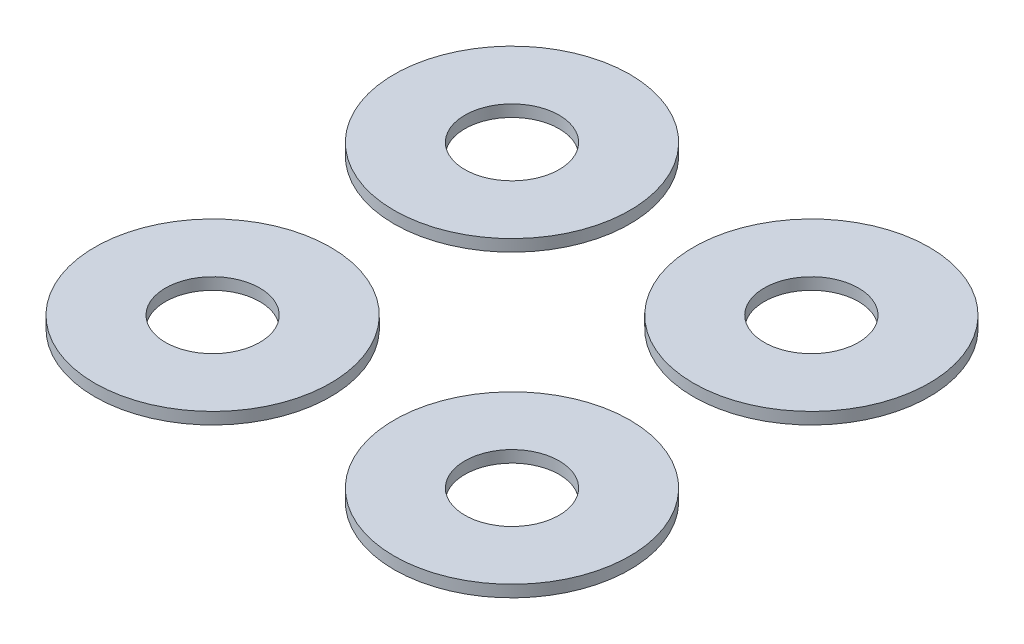
ISO-10303-21;
HEADER;
FILE_DESCRIPTION(('STEP AP214'),'2;1');
FILE_NAME('part.step','',(''),(''),'','','');
FILE_SCHEMA(('AUTOMOTIVE_DESIGN { 1 0 10303 214 1 1 1 1 }'));
ENDSEC;
DATA;
#1=APPLICATION_CONTEXT('core data for automotive mechanical design processes');
#2=APPLICATION_PROTOCOL_DEFINITION('international standard','automotive_design',2000,#1);
#3=PRODUCT_CONTEXT('',#1,'mechanical');
#4=PRODUCT('Part','Part','',(#3));
#5=PRODUCT_RELATED_PRODUCT_CATEGORY('part','',(#4));
#6=PRODUCT_DEFINITION_FORMATION('','',#4);
#7=PRODUCT_DEFINITION_CONTEXT('part definition',#1,'design');
#8=PRODUCT_DEFINITION('design','',#6,#7);
#9=PRODUCT_DEFINITION_SHAPE('','',#8);
#10=(LENGTH_UNIT() NAMED_UNIT(*) SI_UNIT(.MILLI.,.METRE.));
#11=(NAMED_UNIT(*) PLANE_ANGLE_UNIT() SI_UNIT($,.RADIAN.));
#12=(NAMED_UNIT(*) SI_UNIT($,.STERADIAN.) SOLID_ANGLE_UNIT());
#13=UNCERTAINTY_MEASURE_WITH_UNIT(LENGTH_MEASURE(1.E-05),#10,'distance_accuracy_value','');
#14=(GEOMETRIC_REPRESENTATION_CONTEXT(3) GLOBAL_UNCERTAINTY_ASSIGNED_CONTEXT((#13)) GLOBAL_UNIT_ASSIGNED_CONTEXT((#10,
#11,#12)) REPRESENTATION_CONTEXT('',''));
#15=CARTESIAN_POINT('',(0.,0.,0.));
#16=DIRECTION('',(0.,0.,1.));
#17=DIRECTION('',(1.,0.,0.));
#18=AXIS2_PLACEMENT_3D('',#15,#16,#17);
#19=CARTESIAN_POINT('',(0.,0.1,0.));
#20=DIRECTION('',(0.,-1.,0.));
#21=DIRECTION('',(0.,0.,-1.));
#22=AXIS2_PLACEMENT_3D('',#19,#20,#21);
#23=CYLINDRICAL_SURFACE('',#22,1.);
#24=CARTESIAN_POINT('',(0.,0.1,0.));
#25=DIRECTION('',(0.,-1.,0.));
#26=DIRECTION('',(0.,0.,-1.));
#27=AXIS2_PLACEMENT_3D('',#24,#25,#26);
#28=CIRCLE('',#27,1.);
#29=CARTESIAN_POINT('',(0.,0.1,-1.));
#30=VERTEX_POINT('',#29);
#31=EDGE_CURVE('P0_E18',#30,#30,#28,.F.);
#32=ORIENTED_EDGE('',*,*,#31,.F.);
#33=EDGE_LOOP('',(#32));
#34=FACE_BOUND('',#33,.T.);
#35=CARTESIAN_POINT('',(0.,0.,0.));
#36=DIRECTION('',(0.,-1.,0.));
#37=DIRECTION('',(0.,0.,-1.));
#38=AXIS2_PLACEMENT_3D('',#35,#36,#37);
#39=CIRCLE('',#38,1.);
#40=CARTESIAN_POINT('',(0.,0.,-1.));
#41=VERTEX_POINT('',#40);
#42=EDGE_CURVE('P0_E27',#41,#41,#39,.F.);
#43=ORIENTED_EDGE('',*,*,#42,.T.);
#44=EDGE_LOOP('',(#43));
#45=FACE_BOUND('',#44,.T.);
#46=ADVANCED_FACE('P0_F14',(#34,#45),#23,.T.);
#47=CARTESIAN_POINT('',(-1.012,0.1,-1.012));
#48=DIRECTION('',(0.,1.,0.));
#49=DIRECTION('',(0.,0.,1.));
#50=AXIS2_PLACEMENT_3D('',#47,#48,#49);
#51=PLANE('',#50);
#52=CARTESIAN_POINT('',(0.,0.1,0.));
#53=DIRECTION('',(0.,-1.,0.));
#54=DIRECTION('',(0.,0.,-1.));
#55=AXIS2_PLACEMENT_3D('',#52,#53,#54);
#56=CIRCLE('',#55,0.4);
#57=CARTESIAN_POINT('',(0.,0.1,-0.4));
#58=VERTEX_POINT('',#57);
#59=EDGE_CURVE('P0_E22',#58,#58,#56,.F.);
#60=ORIENTED_EDGE('',*,*,#59,.F.);
#61=EDGE_LOOP('',(#60));
#62=FACE_BOUND('',#61,.T.);
#63=ORIENTED_EDGE('',*,*,#31,.T.);
#64=EDGE_LOOP('',(#63));
#65=FACE_BOUND('',#64,.T.);
#66=ADVANCED_FACE('P0_F35',(#62,#65),#51,.T.);
#67=CARTESIAN_POINT('',(-1.012,0.,-1.012));
#68=DIRECTION('',(0.,1.,0.));
#69=DIRECTION('',(0.,0.,1.));
#70=AXIS2_PLACEMENT_3D('',#67,#68,#69);
#71=PLANE('',#70);
#72=CARTESIAN_POINT('',(0.,0.,0.));
#73=DIRECTION('',(0.,-1.,0.));
#74=DIRECTION('',(0.,0.,-1.));
#75=AXIS2_PLACEMENT_3D('',#72,#73,#74);
#76=CIRCLE('',#75,0.4);
#77=CARTESIAN_POINT('',(0.,0.,-0.4));
#78=VERTEX_POINT('',#77);
#79=EDGE_CURVE('P0_E10',#78,#78,#76,.T.);
#80=ORIENTED_EDGE('',*,*,#79,.F.);
#81=EDGE_LOOP('',(#80));
#82=FACE_BOUND('',#81,.T.);
#83=ORIENTED_EDGE('',*,*,#42,.F.);
#84=EDGE_LOOP('',(#83));
#85=FACE_BOUND('',#84,.T.);
#86=ADVANCED_FACE('P0_F16',(#82,#85),#71,.F.);
#87=CARTESIAN_POINT('',(0.,0.1,0.));
#88=DIRECTION('',(0.,-1.,0.));
#89=DIRECTION('',(0.,0.,-1.));
#90=AXIS2_PLACEMENT_3D('',#87,#88,#89);
#91=CYLINDRICAL_SURFACE('',#90,0.4);
#92=ORIENTED_EDGE('',*,*,#79,.T.);
#93=EDGE_LOOP('',(#92));
#94=FACE_BOUND('',#93,.T.);
#95=ORIENTED_EDGE('',*,*,#59,.T.);
#96=EDGE_LOOP('',(#95));
#97=FACE_BOUND('',#96,.T.);
#98=ADVANCED_FACE('P0_F45',(#94,#97),#91,.F.);
#99=CLOSED_SHELL('',(#46,#66,#86,#98));
#100=MANIFOLD_SOLID_BREP('P0_B1',#99);
#101=CARTESIAN_POINT('',(0.,0.1,-2.54));
#102=DIRECTION('',(0.,-1.,0.));
#103=DIRECTION('',(0.,0.,-1.));
#104=AXIS2_PLACEMENT_3D('',#101,#102,#103);
#105=CYLINDRICAL_SURFACE('',#104,1.);
#106=CARTESIAN_POINT('',(0.,0.1,-2.54));
#107=DIRECTION('',(0.,-1.,0.));
#108=DIRECTION('',(0.,0.,-1.));
#109=AXIS2_PLACEMENT_3D('',#106,#107,#108);
#110=CIRCLE('',#109,1.);
#111=CARTESIAN_POINT('',(0.,0.1,-3.54));
#112=VERTEX_POINT('',#111);
#113=EDGE_CURVE('P1_E18',#112,#112,#110,.F.);
#114=ORIENTED_EDGE('',*,*,#113,.F.);
#115=EDGE_LOOP('',(#114));
#116=FACE_BOUND('',#115,.T.);
#117=CARTESIAN_POINT('',(0.,0.,-2.54));
#118=DIRECTION('',(0.,-1.,0.));
#119=DIRECTION('',(0.,0.,-1.));
#120=AXIS2_PLACEMENT_3D('',#117,#118,#119);
#121=CIRCLE('',#120,1.);
#122=CARTESIAN_POINT('',(0.,0.,-3.54));
#123=VERTEX_POINT('',#122);
#124=EDGE_CURVE('P1_E27',#123,#123,#121,.F.);
#125=ORIENTED_EDGE('',*,*,#124,.T.);
#126=EDGE_LOOP('',(#125));
#127=FACE_BOUND('',#126,.T.);
#128=ADVANCED_FACE('P1_F14',(#116,#127),#105,.T.);
#129=CARTESIAN_POINT('',(-1.012,0.1,-3.552));
#130=DIRECTION('',(0.,1.,0.));
#131=DIRECTION('',(0.,0.,1.));
#132=AXIS2_PLACEMENT_3D('',#129,#130,#131);
#133=PLANE('',#132);
#134=CARTESIAN_POINT('',(0.,0.1,-2.54));
#135=DIRECTION('',(0.,-1.,0.));
#136=DIRECTION('',(0.,0.,-1.));
#137=AXIS2_PLACEMENT_3D('',#134,#135,#136);
#138=CIRCLE('',#137,0.4);
#139=CARTESIAN_POINT('',(0.,0.1,-2.94));
#140=VERTEX_POINT('',#139);
#141=EDGE_CURVE('P1_E22',#140,#140,#138,.F.);
#142=ORIENTED_EDGE('',*,*,#141,.F.);
#143=EDGE_LOOP('',(#142));
#144=FACE_BOUND('',#143,.T.);
#145=ORIENTED_EDGE('',*,*,#113,.T.);
#146=EDGE_LOOP('',(#145));
#147=FACE_BOUND('',#146,.T.);
#148=ADVANCED_FACE('P1_F35',(#144,#147),#133,.T.);
#149=CARTESIAN_POINT('',(-1.012,0.,-3.552));
#150=DIRECTION('',(0.,1.,0.));
#151=DIRECTION('',(0.,0.,1.));
#152=AXIS2_PLACEMENT_3D('',#149,#150,#151);
#153=PLANE('',#152);
#154=CARTESIAN_POINT('',(0.,0.,-2.54));
#155=DIRECTION('',(0.,-1.,0.));
#156=DIRECTION('',(0.,0.,-1.));
#157=AXIS2_PLACEMENT_3D('',#154,#155,#156);
#158=CIRCLE('',#157,0.4);
#159=CARTESIAN_POINT('',(0.,0.,-2.94));
#160=VERTEX_POINT('',#159);
#161=EDGE_CURVE('P1_E10',#160,#160,#158,.T.);
#162=ORIENTED_EDGE('',*,*,#161,.F.);
#163=EDGE_LOOP('',(#162));
#164=FACE_BOUND('',#163,.T.);
#165=ORIENTED_EDGE('',*,*,#124,.F.);
#166=EDGE_LOOP('',(#165));
#167=FACE_BOUND('',#166,.T.);
#168=ADVANCED_FACE('P1_F16',(#164,#167),#153,.F.);
#169=CARTESIAN_POINT('',(0.,0.1,-2.54));
#170=DIRECTION('',(0.,-1.,0.));
#171=DIRECTION('',(0.,0.,-1.));
#172=AXIS2_PLACEMENT_3D('',#169,#170,#171);
#173=CYLINDRICAL_SURFACE('',#172,0.4);
#174=ORIENTED_EDGE('',*,*,#161,.T.);
#175=EDGE_LOOP('',(#174));
#176=FACE_BOUND('',#175,.T.);
#177=ORIENTED_EDGE('',*,*,#141,.T.);
#178=EDGE_LOOP('',(#177));
#179=FACE_BOUND('',#178,.T.);
#180=ADVANCED_FACE('P1_F45',(#176,#179),#173,.F.);
#181=CLOSED_SHELL('',(#128,#148,#168,#180));
#182=MANIFOLD_SOLID_BREP('P1_B1',#181);
#183=CARTESIAN_POINT('',(2.54,0.1,-2.54));
#184=DIRECTION('',(0.,-1.,0.));
#185=DIRECTION('',(0.,0.,-1.));
#186=AXIS2_PLACEMENT_3D('',#183,#184,#185);
#187=CYLINDRICAL_SURFACE('',#186,1.);
#188=CARTESIAN_POINT('',(2.54,0.1,-2.54));
#189=DIRECTION('',(0.,-1.,0.));
#190=DIRECTION('',(0.,0.,-1.));
#191=AXIS2_PLACEMENT_3D('',#188,#189,#190);
#192=CIRCLE('',#191,1.);
#193=CARTESIAN_POINT('',(2.54,0.1,-3.54));
#194=VERTEX_POINT('',#193);
#195=EDGE_CURVE('P2_E18',#194,#194,#192,.F.);
#196=ORIENTED_EDGE('',*,*,#195,.F.);
#197=EDGE_LOOP('',(#196));
#198=FACE_BOUND('',#197,.T.);
#199=CARTESIAN_POINT('',(2.54,0.,-2.54));
#200=DIRECTION('',(0.,-1.,0.));
#201=DIRECTION('',(0.,0.,-1.));
#202=AXIS2_PLACEMENT_3D('',#199,#200,#201);
#203=CIRCLE('',#202,1.);
#204=CARTESIAN_POINT('',(2.54,0.,-3.54));
#205=VERTEX_POINT('',#204);
#206=EDGE_CURVE('P2_E27',#205,#205,#203,.F.);
#207=ORIENTED_EDGE('',*,*,#206,.T.);
#208=EDGE_LOOP('',(#207));
#209=FACE_BOUND('',#208,.T.);
#210=ADVANCED_FACE('P2_F14',(#198,#209),#187,.T.);
#211=CARTESIAN_POINT('',(1.528,0.1,-3.552));
#212=DIRECTION('',(0.,1.,0.));
#213=DIRECTION('',(0.,0.,1.));
#214=AXIS2_PLACEMENT_3D('',#211,#212,#213);
#215=PLANE('',#214);
#216=CARTESIAN_POINT('',(2.54,0.1,-2.54));
#217=DIRECTION('',(0.,-1.,0.));
#218=DIRECTION('',(0.,0.,-1.));
#219=AXIS2_PLACEMENT_3D('',#216,#217,#218);
#220=CIRCLE('',#219,0.4);
#221=CARTESIAN_POINT('',(2.54,0.1,-2.94));
#222=VERTEX_POINT('',#221);
#223=EDGE_CURVE('P2_E22',#222,#222,#220,.F.);
#224=ORIENTED_EDGE('',*,*,#223,.F.);
#225=EDGE_LOOP('',(#224));
#226=FACE_BOUND('',#225,.T.);
#227=ORIENTED_EDGE('',*,*,#195,.T.);
#228=EDGE_LOOP('',(#227));
#229=FACE_BOUND('',#228,.T.);
#230=ADVANCED_FACE('P2_F35',(#226,#229),#215,.T.);
#231=CARTESIAN_POINT('',(1.528,0.,-3.552));
#232=DIRECTION('',(0.,1.,0.));
#233=DIRECTION('',(0.,0.,1.));
#234=AXIS2_PLACEMENT_3D('',#231,#232,#233);
#235=PLANE('',#234);
#236=CARTESIAN_POINT('',(2.54,0.,-2.54));
#237=DIRECTION('',(0.,-1.,0.));
#238=DIRECTION('',(0.,0.,-1.));
#239=AXIS2_PLACEMENT_3D('',#236,#237,#238);
#240=CIRCLE('',#239,0.4);
#241=CARTESIAN_POINT('',(2.54,0.,-2.94));
#242=VERTEX_POINT('',#241);
#243=EDGE_CURVE('P2_E10',#242,#242,#240,.T.);
#244=ORIENTED_EDGE('',*,*,#243,.F.);
#245=EDGE_LOOP('',(#244));
#246=FACE_BOUND('',#245,.T.);
#247=ORIENTED_EDGE('',*,*,#206,.F.);
#248=EDGE_LOOP('',(#247));
#249=FACE_BOUND('',#248,.T.);
#250=ADVANCED_FACE('P2_F16',(#246,#249),#235,.F.);
#251=CARTESIAN_POINT('',(2.54,0.1,-2.54));
#252=DIRECTION('',(0.,-1.,0.));
#253=DIRECTION('',(0.,0.,-1.));
#254=AXIS2_PLACEMENT_3D('',#251,#252,#253);
#255=CYLINDRICAL_SURFACE('',#254,0.4);
#256=ORIENTED_EDGE('',*,*,#243,.T.);
#257=EDGE_LOOP('',(#256));
#258=FACE_BOUND('',#257,.T.);
#259=ORIENTED_EDGE('',*,*,#223,.T.);
#260=EDGE_LOOP('',(#259));
#261=FACE_BOUND('',#260,.T.);
#262=ADVANCED_FACE('P2_F45',(#258,#261),#255,.F.);
#263=CLOSED_SHELL('',(#210,#230,#250,#262));
#264=MANIFOLD_SOLID_BREP('P2_B1',#263);
#265=CARTESIAN_POINT('',(2.54,0.1,0.));
#266=DIRECTION('',(0.,-1.,0.));
#267=DIRECTION('',(0.,0.,-1.));
#268=AXIS2_PLACEMENT_3D('',#265,#266,#267);
#269=CYLINDRICAL_SURFACE('',#268,1.);
#270=CARTESIAN_POINT('',(2.54,0.1,0.));
#271=DIRECTION('',(0.,-1.,0.));
#272=DIRECTION('',(0.,0.,-1.));
#273=AXIS2_PLACEMENT_3D('',#270,#271,#272);
#274=CIRCLE('',#273,1.);
#275=CARTESIAN_POINT('',(2.54,0.1,-1.));
#276=VERTEX_POINT('',#275);
#277=EDGE_CURVE('P3_E18',#276,#276,#274,.F.);
#278=ORIENTED_EDGE('',*,*,#277,.F.);
#279=EDGE_LOOP('',(#278));
#280=FACE_BOUND('',#279,.T.);
#281=CARTESIAN_POINT('',(2.54,0.,0.));
#282=DIRECTION('',(0.,-1.,0.));
#283=DIRECTION('',(0.,0.,-1.));
#284=AXIS2_PLACEMENT_3D('',#281,#282,#283);
#285=CIRCLE('',#284,1.);
#286=CARTESIAN_POINT('',(2.54,0.,-1.));
#287=VERTEX_POINT('',#286);
#288=EDGE_CURVE('P3_E27',#287,#287,#285,.F.);
#289=ORIENTED_EDGE('',*,*,#288,.T.);
#290=EDGE_LOOP('',(#289));
#291=FACE_BOUND('',#290,.T.);
#292=ADVANCED_FACE('P3_F14',(#280,#291),#269,.T.);
#293=CARTESIAN_POINT('',(1.528,0.1,-1.012));
#294=DIRECTION('',(0.,1.,0.));
#295=DIRECTION('',(0.,0.,1.));
#296=AXIS2_PLACEMENT_3D('',#293,#294,#295);
#297=PLANE('',#296);
#298=CARTESIAN_POINT('',(2.54,0.1,0.));
#299=DIRECTION('',(0.,-1.,0.));
#300=DIRECTION('',(0.,0.,-1.));
#301=AXIS2_PLACEMENT_3D('',#298,#299,#300);
#302=CIRCLE('',#301,0.4);
#303=CARTESIAN_POINT('',(2.54,0.1,-0.4));
#304=VERTEX_POINT('',#303);
#305=EDGE_CURVE('P3_E22',#304,#304,#302,.F.);
#306=ORIENTED_EDGE('',*,*,#305,.F.);
#307=EDGE_LOOP('',(#306));
#308=FACE_BOUND('',#307,.T.);
#309=ORIENTED_EDGE('',*,*,#277,.T.);
#310=EDGE_LOOP('',(#309));
#311=FACE_BOUND('',#310,.T.);
#312=ADVANCED_FACE('P3_F35',(#308,#311),#297,.T.);
#313=CARTESIAN_POINT('',(1.528,0.,-1.012));
#314=DIRECTION('',(0.,1.,0.));
#315=DIRECTION('',(0.,0.,1.));
#316=AXIS2_PLACEMENT_3D('',#313,#314,#315);
#317=PLANE('',#316);
#318=CARTESIAN_POINT('',(2.54,0.,0.));
#319=DIRECTION('',(0.,-1.,0.));
#320=DIRECTION('',(0.,0.,-1.));
#321=AXIS2_PLACEMENT_3D('',#318,#319,#320);
#322=CIRCLE('',#321,0.4);
#323=CARTESIAN_POINT('',(2.54,0.,-0.4));
#324=VERTEX_POINT('',#323);
#325=EDGE_CURVE('P3_E10',#324,#324,#322,.T.);
#326=ORIENTED_EDGE('',*,*,#325,.F.);
#327=EDGE_LOOP('',(#326));
#328=FACE_BOUND('',#327,.T.);
#329=ORIENTED_EDGE('',*,*,#288,.F.);
#330=EDGE_LOOP('',(#329));
#331=FACE_BOUND('',#330,.T.);
#332=ADVANCED_FACE('P3_F16',(#328,#331),#317,.F.);
#333=CARTESIAN_POINT('',(2.54,0.1,0.));
#334=DIRECTION('',(0.,-1.,0.));
#335=DIRECTION('',(0.,0.,-1.));
#336=AXIS2_PLACEMENT_3D('',#333,#334,#335);
#337=CYLINDRICAL_SURFACE('',#336,0.4);
#338=ORIENTED_EDGE('',*,*,#325,.T.);
#339=EDGE_LOOP('',(#338));
#340=FACE_BOUND('',#339,.T.);
#341=ORIENTED_EDGE('',*,*,#305,.T.);
#342=EDGE_LOOP('',(#341));
#343=FACE_BOUND('',#342,.T.);
#344=ADVANCED_FACE('P3_F45',(#340,#343),#337,.F.);
#345=CLOSED_SHELL('',(#292,#312,#332,#344));
#346=MANIFOLD_SOLID_BREP('P3_B1',#345);
#347=ADVANCED_BREP_SHAPE_REPRESENTATION('',(#18,#100,#182,#264,#346),#14);
#348=SHAPE_DEFINITION_REPRESENTATION(#9,#347);
ENDSEC;
END-ISO-10303-21;
